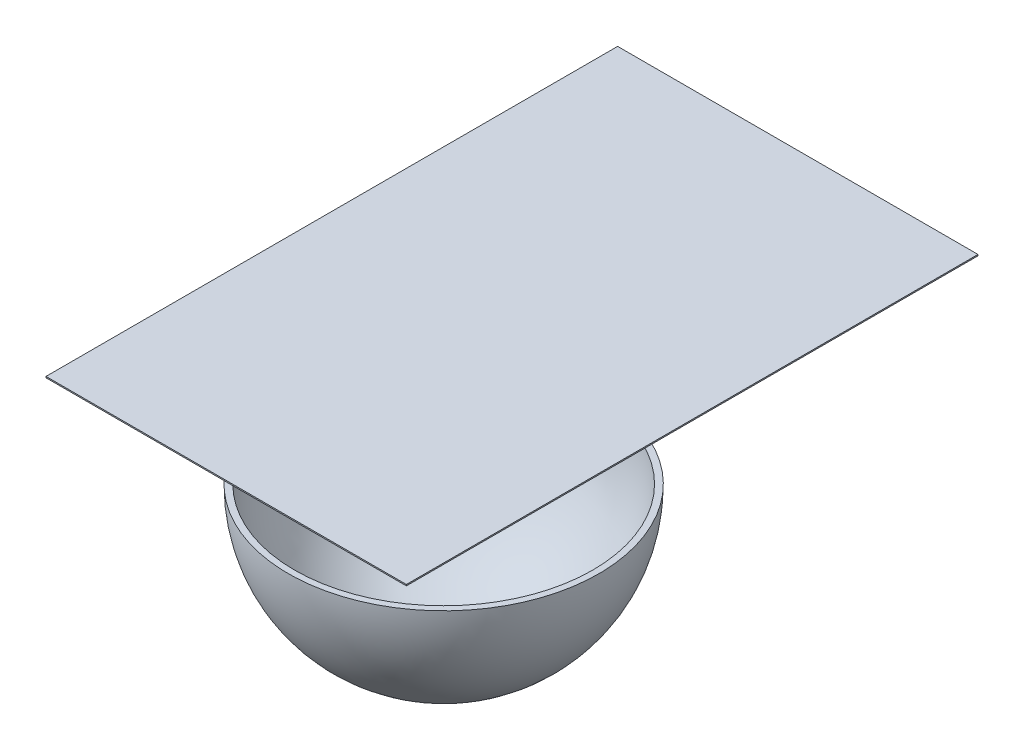
ISO-10303-21;
HEADER;
FILE_DESCRIPTION(('STEP AP214'),'2;1');
FILE_NAME('part.step','',(''),(''),'','','');
FILE_SCHEMA(('AUTOMOTIVE_DESIGN { 1 0 10303 214 1 1 1 1 }'));
ENDSEC;
DATA;
#1=APPLICATION_CONTEXT('core data for automotive mechanical design processes');
#2=APPLICATION_PROTOCOL_DEFINITION('international standard','automotive_design',2000,#1);
#3=PRODUCT_CONTEXT('',#1,'mechanical');
#4=PRODUCT('Part','Part','',(#3));
#5=PRODUCT_RELATED_PRODUCT_CATEGORY('part','',(#4));
#6=PRODUCT_DEFINITION_FORMATION('','',#4);
#7=PRODUCT_DEFINITION_CONTEXT('part definition',#1,'design');
#8=PRODUCT_DEFINITION('design','',#6,#7);
#9=PRODUCT_DEFINITION_SHAPE('','',#8);
#10=(LENGTH_UNIT() NAMED_UNIT(*) SI_UNIT(.MILLI.,.METRE.));
#11=(NAMED_UNIT(*) PLANE_ANGLE_UNIT() SI_UNIT($,.RADIAN.));
#12=(NAMED_UNIT(*) SI_UNIT($,.STERADIAN.) SOLID_ANGLE_UNIT());
#13=UNCERTAINTY_MEASURE_WITH_UNIT(LENGTH_MEASURE(1.E-05),#10,'distance_accuracy_value','');
#14=(GEOMETRIC_REPRESENTATION_CONTEXT(3) GLOBAL_UNCERTAINTY_ASSIGNED_CONTEXT((#13)) GLOBAL_UNIT_ASSIGNED_CONTEXT((#10,
#11,#12)) REPRESENTATION_CONTEXT('',''));
#15=CARTESIAN_POINT('',(0.,0.,0.));
#16=DIRECTION('',(0.,0.,1.));
#17=DIRECTION('',(1.,0.,0.));
#18=AXIS2_PLACEMENT_3D('',#15,#16,#17);
#19=CARTESIAN_POINT('',(-143.585750168985,203.534105422228,-286.165992772786));
#20=DIRECTION('',(-1.,0.,0.));
#21=DIRECTION('',(0.,0.,1.));
#22=AXIS2_PLACEMENT_3D('',#19,#20,#21);
#23=PLANE('',#22);
#24=DIRECTION('',(0.,0.,1.));
#25=VECTOR('',#24,1.);
#26=CARTESIAN_POINT('',(-143.585750168985,204.534105422228,-286.165992772786));
#27=LINE('',#26,#25);
#28=CARTESIAN_POINT('',(-143.585750168985,204.534105422228,-286.165992772786));
#29=VERTEX_POINT('',#28);
#30=CARTESIAN_POINT('',(-143.585750168985,204.534105422228,173.834007227214));
#31=VERTEX_POINT('',#30);
#32=EDGE_CURVE('E113',#29,#31,#27,.T.);
#33=ORIENTED_EDGE('',*,*,#32,.F.);
#34=DIRECTION('',(0.,1.,0.));
#35=VECTOR('',#34,1.);
#36=CARTESIAN_POINT('',(-143.585750168985,203.534105422228,-286.165992772786));
#37=LINE('',#36,#35);
#38=CARTESIAN_POINT('',(-143.585750168985,203.534105422228,-286.165992772786));
#39=VERTEX_POINT('',#38);
#40=EDGE_CURVE('E12',#39,#29,#37,.T.);
#41=ORIENTED_EDGE('',*,*,#40,.F.);
#42=DIRECTION('',(0.,0.,1.));
#43=VECTOR('',#42,1.);
#44=CARTESIAN_POINT('',(-143.585750168985,203.534105422228,-286.165992772786));
#45=LINE('',#44,#43);
#46=CARTESIAN_POINT('',(-143.585750168985,203.534105422228,173.834007227214));
#47=VERTEX_POINT('',#46);
#48=EDGE_CURVE('E107',#39,#47,#45,.T.);
#49=ORIENTED_EDGE('',*,*,#48,.T.);
#50=DIRECTION('',(0.,1.,0.));
#51=VECTOR('',#50,1.);
#52=CARTESIAN_POINT('',(-143.585750168985,203.534105422228,173.834007227214));
#53=LINE('',#52,#51);
#54=EDGE_CURVE('E52',#47,#31,#53,.T.);
#55=ORIENTED_EDGE('',*,*,#54,.T.);
#56=EDGE_LOOP('',(#33,#41,#49,#55));
#57=FACE_BOUND('',#56,.T.);
#58=ADVANCED_FACE('F49',(#57),#23,.T.);
#59=CARTESIAN_POINT('',(-143.585750168985,203.534105422228,-286.165992772786));
#60=DIRECTION('',(0.,0.,-1.));
#61=DIRECTION('',(-1.,0.,0.));
#62=AXIS2_PLACEMENT_3D('',#59,#60,#61);
#63=PLANE('',#62);
#64=DIRECTION('',(-1.,0.,0.));
#65=VECTOR('',#64,1.);
#66=CARTESIAN_POINT('',(-143.585750168985,204.534105422228,-286.165992772786));
#67=LINE('',#66,#65);
#68=CARTESIAN_POINT('',(146.414249831015,204.534105422228,-286.165992772786));
#69=VERTEX_POINT('',#68);
#70=EDGE_CURVE('E109',#69,#29,#67,.T.);
#71=ORIENTED_EDGE('',*,*,#70,.F.);
#72=DIRECTION('',(0.,1.,0.));
#73=VECTOR('',#72,1.);
#74=CARTESIAN_POINT('',(146.414249831015,203.534105422228,-286.165992772786));
#75=LINE('',#74,#73);
#76=CARTESIAN_POINT('',(146.414249831015,203.534105422228,-286.165992772786));
#77=VERTEX_POINT('',#76);
#78=EDGE_CURVE('E58',#77,#69,#75,.T.);
#79=ORIENTED_EDGE('',*,*,#78,.F.);
#80=DIRECTION('',(-1.,0.,0.));
#81=VECTOR('',#80,1.);
#82=CARTESIAN_POINT('',(-143.585750168985,203.534105422228,-286.165992772786));
#83=LINE('',#82,#81);
#84=EDGE_CURVE('E104',#77,#39,#83,.T.);
#85=ORIENTED_EDGE('',*,*,#84,.T.);
#86=ORIENTED_EDGE('',*,*,#40,.T.);
#87=EDGE_LOOP('',(#71,#79,#85,#86));
#88=FACE_BOUND('',#87,.T.);
#89=ADVANCED_FACE('F123',(#88),#63,.T.);
#90=CARTESIAN_POINT('',(146.414249831015,203.534105422228,-286.165992772786));
#91=DIRECTION('',(1.,0.,0.));
#92=DIRECTION('',(0.,0.,-1.));
#93=AXIS2_PLACEMENT_3D('',#90,#91,#92);
#94=PLANE('',#93);
#95=DIRECTION('',(0.,0.,-1.));
#96=VECTOR('',#95,1.);
#97=CARTESIAN_POINT('',(146.414249831015,204.534105422228,-286.165992772786));
#98=LINE('',#97,#96);
#99=CARTESIAN_POINT('',(146.414249831015,204.534105422228,173.834007227214));
#100=VERTEX_POINT('',#99);
#101=EDGE_CURVE('E99',#100,#69,#98,.T.);
#102=ORIENTED_EDGE('',*,*,#101,.F.);
#103=DIRECTION('',(0.,1.,0.));
#104=VECTOR('',#103,1.);
#105=CARTESIAN_POINT('',(146.414249831015,203.534105422228,173.834007227214));
#106=LINE('',#105,#104);
#107=CARTESIAN_POINT('',(146.414249831015,203.534105422228,173.834007227214));
#108=VERTEX_POINT('',#107);
#109=EDGE_CURVE('E94',#108,#100,#106,.T.);
#110=ORIENTED_EDGE('',*,*,#109,.F.);
#111=DIRECTION('',(0.,0.,-1.));
#112=VECTOR('',#111,1.);
#113=CARTESIAN_POINT('',(146.414249831015,203.534105422228,-286.165992772786));
#114=LINE('',#113,#112);
#115=EDGE_CURVE('E97',#108,#77,#114,.T.);
#116=ORIENTED_EDGE('',*,*,#115,.T.);
#117=ORIENTED_EDGE('',*,*,#78,.T.);
#118=EDGE_LOOP('',(#102,#110,#116,#117));
#119=FACE_BOUND('',#118,.T.);
#120=ADVANCED_FACE('F96',(#119),#94,.T.);
#121=CARTESIAN_POINT('',(-143.585750168985,203.534105422228,173.834007227214));
#122=DIRECTION('',(0.,0.,1.));
#123=DIRECTION('',(1.,0.,0.));
#124=AXIS2_PLACEMENT_3D('',#121,#122,#123);
#125=PLANE('',#124);
#126=DIRECTION('',(1.,0.,0.));
#127=VECTOR('',#126,1.);
#128=CARTESIAN_POINT('',(-143.585750168985,204.534105422228,173.834007227214));
#129=LINE('',#128,#127);
#130=EDGE_CURVE('E116',#31,#100,#129,.T.);
#131=ORIENTED_EDGE('',*,*,#130,.F.);
#132=ORIENTED_EDGE('',*,*,#54,.F.);
#133=DIRECTION('',(1.,0.,0.));
#134=VECTOR('',#133,1.);
#135=CARTESIAN_POINT('',(-143.585750168985,203.534105422228,173.834007227214));
#136=LINE('',#135,#134);
#137=EDGE_CURVE('E103',#47,#108,#136,.T.);
#138=ORIENTED_EDGE('',*,*,#137,.T.);
#139=ORIENTED_EDGE('',*,*,#109,.T.);
#140=EDGE_LOOP('',(#131,#132,#138,#139));
#141=FACE_BOUND('',#140,.T.);
#142=ADVANCED_FACE('F106',(#141),#125,.T.);
#143=CARTESIAN_POINT('',(0.,203.534105422228,0.));
#144=DIRECTION('',(0.,1.,0.));
#145=DIRECTION('',(0.,0.,1.));
#146=AXIS2_PLACEMENT_3D('',#143,#144,#145);
#147=PLANE('',#146);
#148=ORIENTED_EDGE('',*,*,#48,.F.);
#149=ORIENTED_EDGE('',*,*,#84,.F.);
#150=ORIENTED_EDGE('',*,*,#115,.F.);
#151=ORIENTED_EDGE('',*,*,#137,.F.);
#152=EDGE_LOOP('',(#148,#149,#150,#151));
#153=FACE_BOUND('',#152,.T.);
#154=ADVANCED_FACE('F102',(#153),#147,.F.);
#155=CARTESIAN_POINT('',(0.,204.534105422228,0.));
#156=DIRECTION('',(0.,1.,0.));
#157=DIRECTION('',(0.,0.,1.));
#158=AXIS2_PLACEMENT_3D('',#155,#156,#157);
#159=PLANE('',#158);
#160=ORIENTED_EDGE('',*,*,#32,.T.);
#161=ORIENTED_EDGE('',*,*,#130,.T.);
#162=ORIENTED_EDGE('',*,*,#101,.T.);
#163=ORIENTED_EDGE('',*,*,#70,.T.);
#164=EDGE_LOOP('',(#160,#161,#162,#163));
#165=FACE_BOUND('',#164,.T.);
#166=ADVANCED_FACE('F122',(#165),#159,.T.);
#167=CLOSED_SHELL('',(#58,#89,#120,#142,#154,#166));
#168=MANIFOLD_SOLID_BREP('B2',#167);
#169=CARTESIAN_POINT('',(1.41424983101454,114.534105422228,-1.16599277278563));
#170=DIRECTION('',(0.,1.,0.));
#171=DIRECTION('',(0.,0.,1.));
#172=AXIS2_PLACEMENT_3D('',#169,#170,#171);
#173=PLANE('',#172);
#174=CARTESIAN_POINT('',(1.41424983101453,114.534105422228,-1.16599277278563));
#175=DIRECTION('',(0.,-1.,0.));
#176=DIRECTION('',(0.,0.,-1.));
#177=AXIS2_PLACEMENT_3D('',#174,#175,#176);
#178=CIRCLE('',#177,125.);
#179=CARTESIAN_POINT('',(1.41424983101453,114.534105422228,-126.165992772786));
#180=VERTEX_POINT('',#179);
#181=EDGE_CURVE('E48',#180,#180,#178,.T.);
#182=ORIENTED_EDGE('',*,*,#181,.F.);
#183=EDGE_LOOP('',(#182));
#184=FACE_BOUND('',#183,.T.);
#185=CARTESIAN_POINT('',(1.41424983101454,114.534105422228,-1.16599277278563));
#186=DIRECTION('',(0.,-1.,0.));
#187=DIRECTION('',(0.,0.,-1.));
#188=AXIS2_PLACEMENT_3D('',#185,#186,#187);
#189=CIRCLE('',#188,120.);
#190=CARTESIAN_POINT('',(1.41424983101454,114.534105422228,-121.165992772786));
#191=VERTEX_POINT('',#190);
#192=EDGE_CURVE('E197',#191,#191,#189,.T.);
#193=ORIENTED_EDGE('',*,*,#192,.T.);
#194=EDGE_LOOP('',(#193));
#195=FACE_BOUND('',#194,.T.);
#196=ADVANCED_FACE('F185',(#184,#195),#173,.T.);
#197=CARTESIAN_POINT('',(36.4142498310145,-5.24829741026217,-1.16599277278563));
#198=DIRECTION('',(0.,-1.,0.));
#199=DIRECTION('',(0.,0.,-1.));
#200=AXIS2_PLACEMENT_3D('',#197,#198,#199);
#201=PLANE('',#200);
#202=CARTESIAN_POINT('',(1.41424983101453,-5.24829741026217,-1.16599277278563));
#203=DIRECTION('',(0.,-1.,0.));
#204=DIRECTION('',(0.,0.,-1.));
#205=AXIS2_PLACEMENT_3D('',#202,#203,#204);
#206=CIRCLE('',#205,35.7375988515611);
#207=CARTESIAN_POINT('',(1.41424983101453,-5.24829741026217,-36.9035916243467));
#208=VERTEX_POINT('',#207);
#209=EDGE_CURVE('E192',#208,#208,#206,.T.);
#210=ORIENTED_EDGE('',*,*,#209,.T.);
#211=EDGE_LOOP('',(#210));
#212=FACE_BOUND('',#211,.T.);
#213=ADVANCED_FACE('F216',(#212),#201,.T.);
#214=CARTESIAN_POINT('',(1.41424983101453,114.534105422228,-1.16599277278563));
#215=DIRECTION('',(0.,-1.,0.));
#216=DIRECTION('',(1.,0.,0.));
#217=AXIS2_PLACEMENT_3D('',#214,#215,#216);
#218=SPHERICAL_SURFACE('',#217,125.);
#219=ORIENTED_EDGE('',*,*,#181,.T.);
#220=EDGE_LOOP('',(#219));
#221=FACE_BOUND('',#220,.T.);
#222=ORIENTED_EDGE('',*,*,#209,.F.);
#223=EDGE_LOOP('',(#222));
#224=FACE_BOUND('',#223,.T.);
#225=ADVANCED_FACE('F209',(#221,#224),#218,.T.);
#226=CARTESIAN_POINT('',(36.4142498310145,-0.248297410262166,-1.16599277278563));
#227=DIRECTION('',(0.,-1.,0.));
#228=DIRECTION('',(0.,0.,-1.));
#229=AXIS2_PLACEMENT_3D('',#226,#227,#228);
#230=PLANE('',#229);
#231=CARTESIAN_POINT('',(1.41424983101454,-0.248297410262166,-1.16599277278563));
#232=DIRECTION('',(0.,-1.,0.));
#233=DIRECTION('',(0.,0.,-1.));
#234=AXIS2_PLACEMENT_3D('',#231,#232,#233);
#235=CIRCLE('',#234,35.);
#236=CARTESIAN_POINT('',(1.41424983101454,-0.248297410262166,-36.1659927727856));
#237=VERTEX_POINT('',#236);
#238=EDGE_CURVE('E188',#237,#237,#235,.T.);
#239=ORIENTED_EDGE('',*,*,#238,.F.);
#240=EDGE_LOOP('',(#239));
#241=FACE_BOUND('',#240,.T.);
#242=ADVANCED_FACE('F207',(#241),#230,.F.);
#243=CARTESIAN_POINT('',(1.41424983101453,114.534105422228,-1.16599277278563));
#244=DIRECTION('',(0.,-1.,0.));
#245=DIRECTION('',(1.,0.,0.));
#246=AXIS2_PLACEMENT_3D('',#243,#244,#245);
#247=SPHERICAL_SURFACE('',#246,120.);
#248=ORIENTED_EDGE('',*,*,#192,.F.);
#249=EDGE_LOOP('',(#248));
#250=FACE_BOUND('',#249,.T.);
#251=ORIENTED_EDGE('',*,*,#238,.T.);
#252=EDGE_LOOP('',(#251));
#253=FACE_BOUND('',#252,.T.);
#254=ADVANCED_FACE('F205',(#250,#253),#247,.F.);
#255=CLOSED_SHELL('',(#196,#213,#225,#242,#254));
#256=MANIFOLD_SOLID_BREP('B6',#255);
#257=ADVANCED_BREP_SHAPE_REPRESENTATION('',(#18,#168,#256),#14);
#258=SHAPE_DEFINITION_REPRESENTATION(#9,#257);
ENDSEC;
END-ISO-10303-21;
